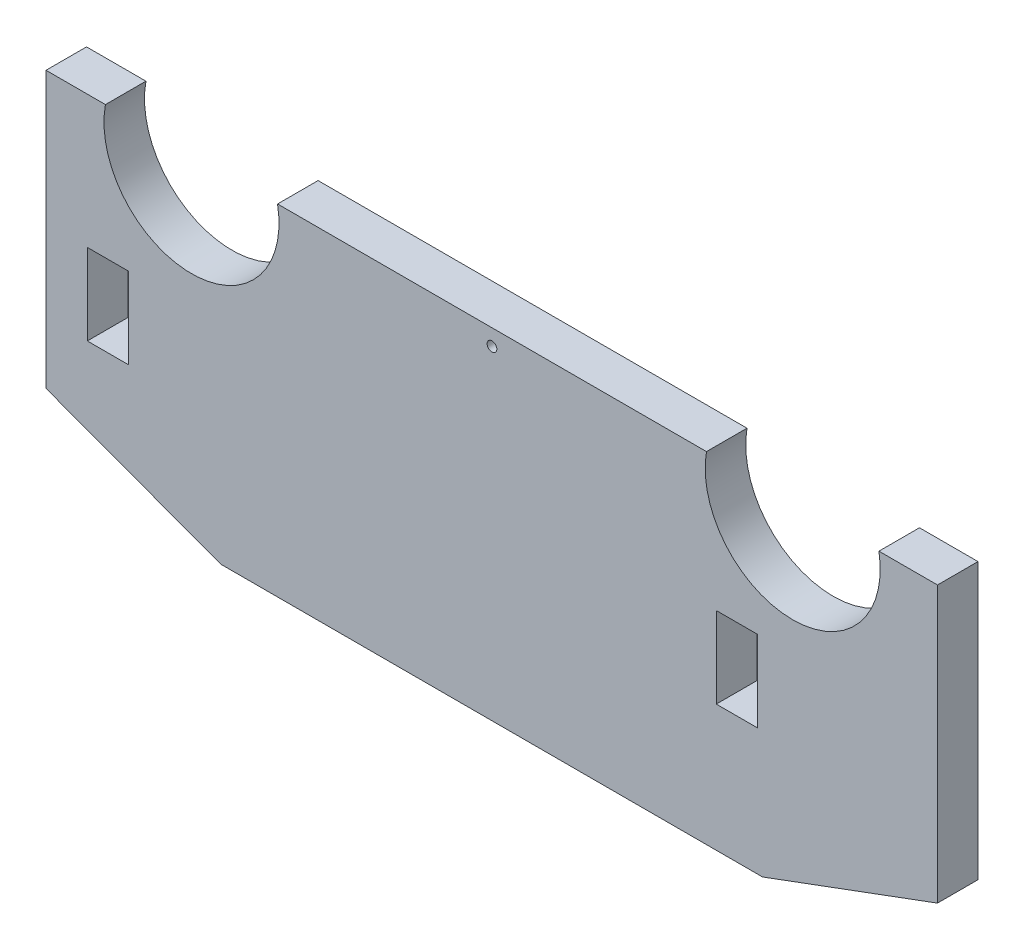
ISO-10303-21;
HEADER;
FILE_DESCRIPTION(('STEP AP214'),'2;1');
FILE_NAME('part.step','',(''),(''),'','','');
FILE_SCHEMA(('AUTOMOTIVE_DESIGN { 1 0 10303 214 1 1 1 1 }'));
ENDSEC;
DATA;
#1=APPLICATION_CONTEXT('core data for automotive mechanical design processes');
#2=APPLICATION_PROTOCOL_DEFINITION('international standard','automotive_design',2000,#1);
#3=PRODUCT_CONTEXT('',#1,'mechanical');
#4=PRODUCT('Part','Part','',(#3));
#5=PRODUCT_RELATED_PRODUCT_CATEGORY('part','',(#4));
#6=PRODUCT_DEFINITION_FORMATION('','',#4);
#7=PRODUCT_DEFINITION_CONTEXT('part definition',#1,'design');
#8=PRODUCT_DEFINITION('design','',#6,#7);
#9=PRODUCT_DEFINITION_SHAPE('','',#8);
#10=(LENGTH_UNIT() NAMED_UNIT(*) SI_UNIT(.MILLI.,.METRE.));
#11=(NAMED_UNIT(*) PLANE_ANGLE_UNIT() SI_UNIT($,.RADIAN.));
#12=(NAMED_UNIT(*) SI_UNIT($,.STERADIAN.) SOLID_ANGLE_UNIT());
#13=UNCERTAINTY_MEASURE_WITH_UNIT(LENGTH_MEASURE(1.E-05),#10,'distance_accuracy_value','');
#14=(GEOMETRIC_REPRESENTATION_CONTEXT(3) GLOBAL_UNCERTAINTY_ASSIGNED_CONTEXT((#13)) GLOBAL_UNIT_ASSIGNED_CONTEXT((#10,
#11,#12)) REPRESENTATION_CONTEXT('',''));
#15=CARTESIAN_POINT('',(0.,0.,0.));
#16=DIRECTION('',(0.,0.,1.));
#17=DIRECTION('',(1.,0.,0.));
#18=AXIS2_PLACEMENT_3D('',#15,#16,#17);
#19=CARTESIAN_POINT('',(-34.925,9.525,3.175));
#20=DIRECTION('',(0.,-1.,0.));
#21=DIRECTION('',(0.,0.,-1.));
#22=AXIS2_PLACEMENT_3D('',#19,#20,#21);
#23=PLANE('',#22);
#24=DIRECTION('',(-1.,0.,0.));
#25=VECTOR('',#24,1.);
#26=CARTESIAN_POINT('',(-34.925,9.525,0.));
#27=LINE('',#26,#25);
#28=CARTESIAN_POINT('',(34.925,9.525,0.));
#29=VERTEX_POINT('',#28);
#30=CARTESIAN_POINT('',(30.337818848547,9.525,0.));
#31=VERTEX_POINT('',#30);
#32=EDGE_CURVE('E187',#29,#31,#27,.T.);
#33=ORIENTED_EDGE('',*,*,#32,.T.);
#34=DIRECTION('',(0.,0.,1.));
#35=VECTOR('',#34,1.);
#36=CARTESIAN_POINT('',(30.337818848547,9.525,0.));
#37=LINE('',#36,#35);
#38=CARTESIAN_POINT('',(30.337818848547,9.525,3.175));
#39=VERTEX_POINT('',#38);
#40=EDGE_CURVE('E46',#31,#39,#37,.T.);
#41=ORIENTED_EDGE('',*,*,#40,.T.);
#42=DIRECTION('',(-1.,0.,0.));
#43=VECTOR('',#42,1.);
#44=CARTESIAN_POINT('',(-34.925,9.525,3.175));
#45=LINE('',#44,#43);
#46=CARTESIAN_POINT('',(34.925,9.525,3.175));
#47=VERTEX_POINT('',#46);
#48=EDGE_CURVE('E168',#47,#39,#45,.T.);
#49=ORIENTED_EDGE('',*,*,#48,.F.);
#50=DIRECTION('',(0.,0.,-1.));
#51=VECTOR('',#50,1.);
#52=CARTESIAN_POINT('',(34.925,9.525,3.175));
#53=LINE('',#52,#51);
#54=EDGE_CURVE('E194',#47,#29,#53,.T.);
#55=ORIENTED_EDGE('',*,*,#54,.T.);
#56=EDGE_LOOP('',(#33,#41,#49,#55));
#57=FACE_BOUND('',#56,.T.);
#58=ADVANCED_FACE('F32',(#57),#23,.F.);
#59=CARTESIAN_POINT('',(16.8247980446848,9.525,3.175));
#60=VERTEX_POINT('',#59);
#61=CARTESIAN_POINT('',(-16.781802364217,9.525,3.175));
#62=VERTEX_POINT('',#61);
#63=EDGE_CURVE('E165',#60,#62,#45,.T.);
#64=ORIENTED_EDGE('',*,*,#63,.F.);
#65=DIRECTION('',(0.,0.,1.));
#66=VECTOR('',#65,1.);
#67=CARTESIAN_POINT('',(16.8247980446848,9.525,0.));
#68=LINE('',#67,#66);
#69=CARTESIAN_POINT('',(16.8247980446848,9.525,0.));
#70=VERTEX_POINT('',#69);
#71=EDGE_CURVE('E155',#60,#70,#68,.F.);
#72=ORIENTED_EDGE('',*,*,#71,.T.);
#73=CARTESIAN_POINT('',(-16.781802364217,9.525,0.));
#74=VERTEX_POINT('',#73);
#75=EDGE_CURVE('E54',#70,#74,#27,.T.);
#76=ORIENTED_EDGE('',*,*,#75,.T.);
#77=DIRECTION('',(0.,0.,1.));
#78=VECTOR('',#77,1.);
#79=CARTESIAN_POINT('',(-16.781802364217,9.525,0.));
#80=LINE('',#79,#78);
#81=EDGE_CURVE('E172',#74,#62,#80,.T.);
#82=ORIENTED_EDGE('',*,*,#81,.T.);
#83=EDGE_LOOP('',(#64,#72,#76,#82));
#84=FACE_BOUND('',#83,.T.);
#85=ADVANCED_FACE('F171',(#84),#23,.F.);
#86=CARTESIAN_POINT('',(34.925,-9.525,3.175));
#87=DIRECTION('',(-1.,0.,0.));
#88=DIRECTION('',(0.,0.,1.));
#89=AXIS2_PLACEMENT_3D('',#86,#87,#88);
#90=PLANE('',#89);
#91=DIRECTION('',(0.,1.,0.));
#92=VECTOR('',#91,1.);
#93=CARTESIAN_POINT('',(34.925,-9.525,0.));
#94=LINE('',#93,#92);
#95=CARTESIAN_POINT('',(34.925,-12.065,0.));
#96=VERTEX_POINT('',#95);
#97=EDGE_CURVE('E182',#96,#29,#94,.T.);
#98=ORIENTED_EDGE('',*,*,#97,.T.);
#99=ORIENTED_EDGE('',*,*,#54,.F.);
#100=DIRECTION('',(0.,1.,0.));
#101=VECTOR('',#100,1.);
#102=CARTESIAN_POINT('',(34.925,-9.525,3.175));
#103=LINE('',#102,#101);
#104=CARTESIAN_POINT('',(34.925,-12.065,3.175));
#105=VERTEX_POINT('',#104);
#106=EDGE_CURVE('E176',#105,#47,#103,.T.);
#107=ORIENTED_EDGE('',*,*,#106,.F.);
#108=DIRECTION('',(0.,0.,1.));
#109=VECTOR('',#108,1.);
#110=CARTESIAN_POINT('',(34.925,-12.065,0.));
#111=LINE('',#110,#109);
#112=EDGE_CURVE('E233',#96,#105,#111,.T.);
#113=ORIENTED_EDGE('',*,*,#112,.F.);
#114=EDGE_LOOP('',(#98,#99,#107,#113));
#115=FACE_BOUND('',#114,.T.);
#116=ADVANCED_FACE('F34',(#115),#90,.F.);
#117=CARTESIAN_POINT('',(-30.2698721922055,9.525,3.175));
#118=VERTEX_POINT('',#117);
#119=CARTESIAN_POINT('',(-34.925,9.525,3.175));
#120=VERTEX_POINT('',#119);
#121=EDGE_CURVE('E173',#118,#120,#45,.T.);
#122=ORIENTED_EDGE('',*,*,#121,.F.);
#123=DIRECTION('',(0.,0.,1.));
#124=VECTOR('',#123,1.);
#125=CARTESIAN_POINT('',(-30.2698721922055,9.525,0.));
#126=LINE('',#125,#124);
#127=CARTESIAN_POINT('',(-30.2698721922055,9.525,0.));
#128=VERTEX_POINT('',#127);
#129=EDGE_CURVE('E200',#118,#128,#126,.F.);
#130=ORIENTED_EDGE('',*,*,#129,.T.);
#131=CARTESIAN_POINT('',(-34.925,9.525,0.));
#132=VERTEX_POINT('',#131);
#133=EDGE_CURVE('E185',#128,#132,#27,.T.);
#134=ORIENTED_EDGE('',*,*,#133,.T.);
#135=DIRECTION('',(0.,0.,-1.));
#136=VECTOR('',#135,1.);
#137=CARTESIAN_POINT('',(-34.925,9.525,3.175));
#138=LINE('',#137,#136);
#139=EDGE_CURVE('E181',#120,#132,#138,.T.);
#140=ORIENTED_EDGE('',*,*,#139,.F.);
#141=EDGE_LOOP('',(#122,#130,#134,#140));
#142=FACE_BOUND('',#141,.T.);
#143=ADVANCED_FACE('F205',(#142),#23,.F.);
#144=CARTESIAN_POINT('',(-34.925,-9.525,3.175));
#145=DIRECTION('',(1.,0.,0.));
#146=DIRECTION('',(0.,0.,-1.));
#147=AXIS2_PLACEMENT_3D('',#144,#145,#146);
#148=PLANE('',#147);
#149=DIRECTION('',(0.,-1.,0.));
#150=VECTOR('',#149,1.);
#151=CARTESIAN_POINT('',(-34.925,-9.525,0.));
#152=LINE('',#151,#150);
#153=CARTESIAN_POINT('',(-34.925,-12.065,0.));
#154=VERTEX_POINT('',#153);
#155=EDGE_CURVE('E190',#132,#154,#152,.T.);
#156=ORIENTED_EDGE('',*,*,#155,.T.);
#157=DIRECTION('',(0.,0.,1.));
#158=VECTOR('',#157,1.);
#159=CARTESIAN_POINT('',(-34.925,-12.065,0.));
#160=LINE('',#159,#158);
#161=CARTESIAN_POINT('',(-34.925,-12.065,3.175));
#162=VERTEX_POINT('',#161);
#163=EDGE_CURVE('E221',#154,#162,#160,.T.);
#164=ORIENTED_EDGE('',*,*,#163,.T.);
#165=DIRECTION('',(0.,-1.,0.));
#166=VECTOR('',#165,1.);
#167=CARTESIAN_POINT('',(-34.925,-9.525,3.175));
#168=LINE('',#167,#166);
#169=EDGE_CURVE('E175',#120,#162,#168,.T.);
#170=ORIENTED_EDGE('',*,*,#169,.F.);
#171=ORIENTED_EDGE('',*,*,#139,.T.);
#172=EDGE_LOOP('',(#156,#164,#170,#171));
#173=FACE_BOUND('',#172,.T.);
#174=ADVANCED_FACE('F219',(#173),#148,.F.);
#175=CARTESIAN_POINT('',(34.925,9.525,3.175));
#176=DIRECTION('',(0.,0.,-1.));
#177=DIRECTION('',(-1.,0.,0.));
#178=AXIS2_PLACEMENT_3D('',#175,#176,#177);
#179=PLANE('',#178);
#180=CARTESIAN_POINT('',(0.018631461536054,8.255,3.175));
#181=DIRECTION('',(0.,0.,1.));
#182=DIRECTION('',(1.,0.,0.));
#183=AXIS2_PLACEMENT_3D('',#180,#181,#182);
#184=CIRCLE('',#183,0.381);
#185=CARTESIAN_POINT('',(0.399631461536054,8.255,3.175));
#186=VERTEX_POINT('',#185);
#187=EDGE_CURVE('E314',#186,#186,#184,.T.);
#188=ORIENTED_EDGE('',*,*,#187,.F.);
#189=EDGE_LOOP('',(#188));
#190=FACE_BOUND('',#189,.T.);
#191=DIRECTION('',(-1.,0.,0.));
#192=VECTOR('',#191,1.);
#193=CARTESIAN_POINT('',(17.5928228104329,-0.875352195852146,3.175));
#194=LINE('',#193,#192);
#195=CARTESIAN_POINT('',(20.8186228104329,-0.875352195852146,3.175));
#196=VERTEX_POINT('',#195);
#197=CARTESIAN_POINT('',(17.5928228104329,-0.875352195852146,3.175));
#198=VERTEX_POINT('',#197);
#199=EDGE_CURVE('E296',#196,#198,#194,.T.);
#200=ORIENTED_EDGE('',*,*,#199,.F.);
#201=DIRECTION('',(0.,1.,0.));
#202=VECTOR('',#201,1.);
#203=CARTESIAN_POINT('',(20.8186228104329,-0.875352195852146,3.175));
#204=LINE('',#203,#202);
#205=CARTESIAN_POINT('',(20.8186228104329,-7.22535219585215,3.175));
#206=VERTEX_POINT('',#205);
#207=EDGE_CURVE('E299',#206,#196,#204,.T.);
#208=ORIENTED_EDGE('',*,*,#207,.F.);
#209=DIRECTION('',(1.,0.,0.));
#210=VECTOR('',#209,1.);
#211=CARTESIAN_POINT('',(17.5928228104329,-7.22535219585215,3.175));
#212=LINE('',#211,#210);
#213=CARTESIAN_POINT('',(17.5928228104329,-7.22535219585215,3.175));
#214=VERTEX_POINT('',#213);
#215=EDGE_CURVE('E289',#214,#206,#212,.T.);
#216=ORIENTED_EDGE('',*,*,#215,.F.);
#217=DIRECTION('',(0.,-1.,0.));
#218=VECTOR('',#217,1.);
#219=CARTESIAN_POINT('',(17.5928228104329,-0.875352195852146,3.175));
#220=LINE('',#219,#218);
#221=EDGE_CURVE('E293',#198,#214,#220,.T.);
#222=ORIENTED_EDGE('',*,*,#221,.F.);
#223=EDGE_LOOP('',(#200,#208,#216,#222));
#224=FACE_BOUND('',#223,.T.);
#225=DIRECTION('',(-1.,0.,0.));
#226=VECTOR('',#225,1.);
#227=CARTESIAN_POINT('',(-31.6890002778656,-0.875352195852147,3.175));
#228=LINE('',#227,#226);
#229=CARTESIAN_POINT('',(-28.4632002778656,-0.875352195852146,3.175));
#230=VERTEX_POINT('',#229);
#231=CARTESIAN_POINT('',(-31.6890002778656,-0.875352195852147,3.175));
#232=VERTEX_POINT('',#231);
#233=EDGE_CURVE('E264',#230,#232,#228,.T.);
#234=ORIENTED_EDGE('',*,*,#233,.F.);
#235=DIRECTION('',(0.,1.,0.));
#236=VECTOR('',#235,1.);
#237=CARTESIAN_POINT('',(-28.4632002778656,-0.875352195852147,3.175));
#238=LINE('',#237,#236);
#239=CARTESIAN_POINT('',(-28.4632002778656,-7.22535219585215,3.175));
#240=VERTEX_POINT('',#239);
#241=EDGE_CURVE('E267',#240,#230,#238,.T.);
#242=ORIENTED_EDGE('',*,*,#241,.F.);
#243=DIRECTION('',(1.,0.,0.));
#244=VECTOR('',#243,1.);
#245=CARTESIAN_POINT('',(-31.6890002778656,-7.22535219585215,3.175));
#246=LINE('',#245,#244);
#247=CARTESIAN_POINT('',(-31.6890002778656,-7.22535219585215,3.175));
#248=VERTEX_POINT('',#247);
#249=EDGE_CURVE('E257',#248,#240,#246,.T.);
#250=ORIENTED_EDGE('',*,*,#249,.F.);
#251=DIRECTION('',(0.,-1.,0.));
#252=VECTOR('',#251,1.);
#253=CARTESIAN_POINT('',(-31.6890002778656,-0.875352195852147,3.175));
#254=LINE('',#253,#252);
#255=EDGE_CURVE('E261',#232,#248,#254,.T.);
#256=ORIENTED_EDGE('',*,*,#255,.F.);
#257=EDGE_LOOP('',(#234,#242,#250,#256));
#258=FACE_BOUND('',#257,.T.);
#259=ORIENTED_EDGE('',*,*,#48,.T.);
#260=CARTESIAN_POINT('',(23.5813084466159,8.34952937571165,3.175));
#261=DIRECTION('',(0.,0.,1.));
#262=DIRECTION('',(1.,0.,0.));
#263=AXIS2_PLACEMENT_3D('',#260,#261,#262);
#264=CIRCLE('',#263,6.85799999999766);
#265=EDGE_CURVE('E158',#60,#39,#264,.T.);
#266=ORIENTED_EDGE('',*,*,#265,.F.);
#267=ORIENTED_EDGE('',*,*,#63,.T.);
#268=CARTESIAN_POINT('',(-23.5258372782112,8.2799469574375,3.175));
#269=DIRECTION('',(0.,0.,1.));
#270=DIRECTION('',(1.,0.,0.));
#271=AXIS2_PLACEMENT_3D('',#268,#269,#270);
#272=CIRCLE('',#271,6.85799999999766);
#273=EDGE_CURVE('E207',#118,#62,#272,.T.);
#274=ORIENTED_EDGE('',*,*,#273,.F.);
#275=ORIENTED_EDGE('',*,*,#121,.T.);
#276=ORIENTED_EDGE('',*,*,#169,.T.);
#277=DIRECTION('',(0.937699685695736,-0.347446829667674,0.));
#278=VECTOR('',#277,1.);
#279=CARTESIAN_POINT('',(-34.925,-12.065,3.175));
#280=LINE('',#279,#278);
#281=CARTESIAN_POINT('',(-21.2149471326576,-17.145,3.175));
#282=VERTEX_POINT('',#281);
#283=EDGE_CURVE('E226',#162,#282,#280,.T.);
#284=ORIENTED_EDGE('',*,*,#283,.T.);
#285=DIRECTION('',(1.,0.,0.));
#286=VECTOR('',#285,1.);
#287=CARTESIAN_POINT('',(-21.2149471326576,-17.145,3.175));
#288=LINE('',#287,#286);
#289=CARTESIAN_POINT('',(21.2149471326576,-17.145,3.175));
#290=VERTEX_POINT('',#289);
#291=EDGE_CURVE('E231',#282,#290,#288,.T.);
#292=ORIENTED_EDGE('',*,*,#291,.T.);
#293=DIRECTION('',(-0.937699685695736,-0.347446829667674,0.));
#294=VECTOR('',#293,1.);
#295=CARTESIAN_POINT('',(34.925,-12.065,3.175));
#296=LINE('',#295,#294);
#297=EDGE_CURVE('E242',#105,#290,#296,.T.);
#298=ORIENTED_EDGE('',*,*,#297,.F.);
#299=ORIENTED_EDGE('',*,*,#106,.T.);
#300=EDGE_LOOP('',(#259,#266,#267,#274,#275,#276,#284,#292,#298,#299));
#301=FACE_BOUND('',#300,.T.);
#302=ADVANCED_FACE('F163',(#190,#224,#258,#301),#179,.F.);
#303=CARTESIAN_POINT('',(34.925,9.525,0.));
#304=DIRECTION('',(0.,0.,-1.));
#305=DIRECTION('',(-1.,0.,0.));
#306=AXIS2_PLACEMENT_3D('',#303,#304,#305);
#307=PLANE('',#306);
#308=CARTESIAN_POINT('',(0.018631461536054,8.255,0.));
#309=DIRECTION('',(0.,0.,1.));
#310=DIRECTION('',(1.,0.,0.));
#311=AXIS2_PLACEMENT_3D('',#308,#309,#310);
#312=CIRCLE('',#311,0.381);
#313=CARTESIAN_POINT('',(0.399631461536054,8.255,0.));
#314=VERTEX_POINT('',#313);
#315=EDGE_CURVE('E169',#314,#314,#312,.T.);
#316=ORIENTED_EDGE('',*,*,#315,.T.);
#317=EDGE_LOOP('',(#316));
#318=FACE_BOUND('',#317,.T.);
#319=CARTESIAN_POINT('',(23.5813084466159,8.34952937571165,0.));
#320=DIRECTION('',(0.,0.,-1.));
#321=DIRECTION('',(-1.,0.,0.));
#322=AXIS2_PLACEMENT_3D('',#319,#320,#321);
#323=CIRCLE('',#322,6.85799999999766);
#324=EDGE_CURVE('E11',#31,#70,#323,.T.);
#325=ORIENTED_EDGE('',*,*,#324,.F.);
#326=ORIENTED_EDGE('',*,*,#32,.F.);
#327=ORIENTED_EDGE('',*,*,#97,.F.);
#328=DIRECTION('',(-0.937699685695736,-0.347446829667674,0.));
#329=VECTOR('',#328,1.);
#330=CARTESIAN_POINT('',(34.925,-12.065,0.));
#331=LINE('',#330,#329);
#332=CARTESIAN_POINT('',(21.2149471326576,-17.145,0.));
#333=VERTEX_POINT('',#332);
#334=EDGE_CURVE('E239',#96,#333,#331,.T.);
#335=ORIENTED_EDGE('',*,*,#334,.T.);
#336=DIRECTION('',(1.,0.,0.));
#337=VECTOR('',#336,1.);
#338=CARTESIAN_POINT('',(-21.2149471326576,-17.145,0.));
#339=LINE('',#338,#337);
#340=CARTESIAN_POINT('',(-21.2149471326576,-17.145,0.));
#341=VERTEX_POINT('',#340);
#342=EDGE_CURVE('E227',#341,#333,#339,.T.);
#343=ORIENTED_EDGE('',*,*,#342,.F.);
#344=DIRECTION('',(0.937699685695736,-0.347446829667674,0.));
#345=VECTOR('',#344,1.);
#346=CARTESIAN_POINT('',(-34.925,-12.065,0.));
#347=LINE('',#346,#345);
#348=EDGE_CURVE('E215',#154,#341,#347,.T.);
#349=ORIENTED_EDGE('',*,*,#348,.F.);
#350=ORIENTED_EDGE('',*,*,#155,.F.);
#351=ORIENTED_EDGE('',*,*,#133,.F.);
#352=CARTESIAN_POINT('',(-23.5258372782112,8.2799469574375,0.));
#353=DIRECTION('',(0.,0.,-1.));
#354=DIRECTION('',(-1.,0.,0.));
#355=AXIS2_PLACEMENT_3D('',#352,#353,#354);
#356=CIRCLE('',#355,6.85799999999766);
#357=EDGE_CURVE('E40',#74,#128,#356,.T.);
#358=ORIENTED_EDGE('',*,*,#357,.F.);
#359=ORIENTED_EDGE('',*,*,#75,.F.);
#360=EDGE_LOOP('',(#325,#326,#327,#335,#343,#349,#350,#351,#358,#359));
#361=FACE_BOUND('',#360,.T.);
#362=DIRECTION('',(0.,1.,0.));
#363=VECTOR('',#362,1.);
#364=CARTESIAN_POINT('',(20.8186228104329,-0.875352195852146,0.));
#365=LINE('',#364,#363);
#366=CARTESIAN_POINT('',(20.8186228104329,-7.22535219585215,0.));
#367=VERTEX_POINT('',#366);
#368=CARTESIAN_POINT('',(20.8186228104329,-0.875352195852146,0.));
#369=VERTEX_POINT('',#368);
#370=EDGE_CURVE('E292',#367,#369,#365,.T.);
#371=ORIENTED_EDGE('',*,*,#370,.T.);
#372=DIRECTION('',(-1.,0.,0.));
#373=VECTOR('',#372,1.);
#374=CARTESIAN_POINT('',(17.5928228104329,-0.875352195852146,0.));
#375=LINE('',#374,#373);
#376=CARTESIAN_POINT('',(17.5928228104329,-0.875352195852146,0.));
#377=VERTEX_POINT('',#376);
#378=EDGE_CURVE('E306',#369,#377,#375,.T.);
#379=ORIENTED_EDGE('',*,*,#378,.T.);
#380=DIRECTION('',(0.,-1.,0.));
#381=VECTOR('',#380,1.);
#382=CARTESIAN_POINT('',(17.5928228104329,-0.875352195852146,0.));
#383=LINE('',#382,#381);
#384=CARTESIAN_POINT('',(17.5928228104329,-7.22535219585215,0.));
#385=VERTEX_POINT('',#384);
#386=EDGE_CURVE('E303',#377,#385,#383,.T.);
#387=ORIENTED_EDGE('',*,*,#386,.T.);
#388=DIRECTION('',(1.,0.,0.));
#389=VECTOR('',#388,1.);
#390=CARTESIAN_POINT('',(17.5928228104329,-7.22535219585215,0.));
#391=LINE('',#390,#389);
#392=EDGE_CURVE('E284',#385,#367,#391,.T.);
#393=ORIENTED_EDGE('',*,*,#392,.T.);
#394=EDGE_LOOP('',(#371,#379,#387,#393));
#395=FACE_BOUND('',#394,.T.);
#396=DIRECTION('',(0.,1.,0.));
#397=VECTOR('',#396,1.);
#398=CARTESIAN_POINT('',(-28.4632002778656,-0.875352195852147,0.));
#399=LINE('',#398,#397);
#400=CARTESIAN_POINT('',(-28.4632002778656,-7.22535219585215,0.));
#401=VERTEX_POINT('',#400);
#402=CARTESIAN_POINT('',(-28.4632002778656,-0.875352195852147,0.));
#403=VERTEX_POINT('',#402);
#404=EDGE_CURVE('E260',#401,#403,#399,.T.);
#405=ORIENTED_EDGE('',*,*,#404,.T.);
#406=DIRECTION('',(-1.,0.,0.));
#407=VECTOR('',#406,1.);
#408=CARTESIAN_POINT('',(-31.6890002778656,-0.875352195852147,0.));
#409=LINE('',#408,#407);
#410=CARTESIAN_POINT('',(-31.6890002778656,-0.875352195852146,0.));
#411=VERTEX_POINT('',#410);
#412=EDGE_CURVE('E275',#403,#411,#409,.T.);
#413=ORIENTED_EDGE('',*,*,#412,.T.);
#414=DIRECTION('',(0.,-1.,0.));
#415=VECTOR('',#414,1.);
#416=CARTESIAN_POINT('',(-31.6890002778656,-0.875352195852147,0.));
#417=LINE('',#416,#415);
#418=CARTESIAN_POINT('',(-31.6890002778656,-7.22535219585215,0.));
#419=VERTEX_POINT('',#418);
#420=EDGE_CURVE('E272',#411,#419,#417,.T.);
#421=ORIENTED_EDGE('',*,*,#420,.T.);
#422=DIRECTION('',(1.,0.,0.));
#423=VECTOR('',#422,1.);
#424=CARTESIAN_POINT('',(-31.6890002778656,-7.22535219585215,0.));
#425=LINE('',#424,#423);
#426=EDGE_CURVE('E252',#419,#401,#425,.T.);
#427=ORIENTED_EDGE('',*,*,#426,.T.);
#428=EDGE_LOOP('',(#405,#413,#421,#427));
#429=FACE_BOUND('',#428,.T.);
#430=ADVANCED_FACE('F210',(#318,#361,#395,#429),#307,.T.);
#431=CARTESIAN_POINT('',(-21.2149471326576,-17.145,0.));
#432=DIRECTION('',(0.,-1.,0.));
#433=DIRECTION('',(0.,0.,-1.));
#434=AXIS2_PLACEMENT_3D('',#431,#432,#433);
#435=PLANE('',#434);
#436=ORIENTED_EDGE('',*,*,#291,.F.);
#437=DIRECTION('',(0.,0.,1.));
#438=VECTOR('',#437,1.);
#439=CARTESIAN_POINT('',(-21.2149471326576,-17.145,0.));
#440=LINE('',#439,#438);
#441=EDGE_CURVE('E186',#341,#282,#440,.T.);
#442=ORIENTED_EDGE('',*,*,#441,.F.);
#443=ORIENTED_EDGE('',*,*,#342,.T.);
#444=DIRECTION('',(0.,0.,1.));
#445=VECTOR('',#444,1.);
#446=CARTESIAN_POINT('',(21.2149471326576,-17.145,0.));
#447=LINE('',#446,#445);
#448=EDGE_CURVE('E236',#333,#290,#447,.T.);
#449=ORIENTED_EDGE('',*,*,#448,.T.);
#450=EDGE_LOOP('',(#436,#442,#443,#449));
#451=FACE_BOUND('',#450,.T.);
#452=ADVANCED_FACE('F352',(#451),#435,.T.);
#453=CARTESIAN_POINT('',(-34.925,-12.065,0.));
#454=DIRECTION('',(-0.347446829667674,-0.937699685695736,0.));
#455=DIRECTION('',(0.937699685695736,-0.347446829667674,0.));
#456=AXIS2_PLACEMENT_3D('',#453,#454,#455);
#457=PLANE('',#456);
#458=ORIENTED_EDGE('',*,*,#283,.F.);
#459=ORIENTED_EDGE('',*,*,#163,.F.);
#460=ORIENTED_EDGE('',*,*,#348,.T.);
#461=ORIENTED_EDGE('',*,*,#441,.T.);
#462=EDGE_LOOP('',(#458,#459,#460,#461));
#463=FACE_BOUND('',#462,.T.);
#464=ADVANCED_FACE('F224',(#463),#457,.T.);
#465=CARTESIAN_POINT('',(34.925,-12.065,0.));
#466=DIRECTION('',(-0.347446829667674,0.937699685695736,0.));
#467=DIRECTION('',(-0.937699685695736,-0.347446829667674,0.));
#468=AXIS2_PLACEMENT_3D('',#465,#466,#467);
#469=PLANE('',#468);
#470=ORIENTED_EDGE('',*,*,#297,.T.);
#471=ORIENTED_EDGE('',*,*,#448,.F.);
#472=ORIENTED_EDGE('',*,*,#334,.F.);
#473=ORIENTED_EDGE('',*,*,#112,.T.);
#474=EDGE_LOOP('',(#470,#471,#472,#473));
#475=FACE_BOUND('',#474,.T.);
#476=ADVANCED_FACE('F380',(#475),#469,.F.);
#477=CARTESIAN_POINT('',(-28.4632002778656,-0.875352195852147,0.));
#478=DIRECTION('',(1.,0.,0.));
#479=DIRECTION('',(0.,0.,-1.));
#480=AXIS2_PLACEMENT_3D('',#477,#478,#479);
#481=PLANE('',#480);
#482=ORIENTED_EDGE('',*,*,#241,.T.);
#483=DIRECTION('',(0.,0.,1.));
#484=VECTOR('',#483,1.);
#485=CARTESIAN_POINT('',(-28.4632002778656,-0.875352195852147,0.));
#486=LINE('',#485,#484);
#487=EDGE_CURVE('E248',#403,#230,#486,.T.);
#488=ORIENTED_EDGE('',*,*,#487,.F.);
#489=ORIENTED_EDGE('',*,*,#404,.F.);
#490=DIRECTION('',(0.,0.,1.));
#491=VECTOR('',#490,1.);
#492=CARTESIAN_POINT('',(-28.4632002778656,-7.22535219585215,0.));
#493=LINE('',#492,#491);
#494=EDGE_CURVE('E245',#401,#240,#493,.T.);
#495=ORIENTED_EDGE('',*,*,#494,.T.);
#496=EDGE_LOOP('',(#482,#488,#489,#495));
#497=FACE_BOUND('',#496,.T.);
#498=ADVANCED_FACE('F344',(#497),#481,.F.);
#499=CARTESIAN_POINT('',(-31.6890002778656,-7.22535219585215,0.));
#500=DIRECTION('',(0.,-1.,0.));
#501=DIRECTION('',(0.,0.,-1.));
#502=AXIS2_PLACEMENT_3D('',#499,#500,#501);
#503=PLANE('',#502);
#504=ORIENTED_EDGE('',*,*,#249,.T.);
#505=ORIENTED_EDGE('',*,*,#494,.F.);
#506=ORIENTED_EDGE('',*,*,#426,.F.);
#507=DIRECTION('',(0.,0.,1.));
#508=VECTOR('',#507,1.);
#509=CARTESIAN_POINT('',(-31.6890002778656,-7.22535219585215,0.));
#510=LINE('',#509,#508);
#511=EDGE_CURVE('E254',#419,#248,#510,.T.);
#512=ORIENTED_EDGE('',*,*,#511,.T.);
#513=EDGE_LOOP('',(#504,#505,#506,#512));
#514=FACE_BOUND('',#513,.T.);
#515=ADVANCED_FACE('F347',(#514),#503,.F.);
#516=CARTESIAN_POINT('',(-31.6890002778656,-0.875352195852147,0.));
#517=DIRECTION('',(-1.,0.,0.));
#518=DIRECTION('',(0.,0.,1.));
#519=AXIS2_PLACEMENT_3D('',#516,#517,#518);
#520=PLANE('',#519);
#521=ORIENTED_EDGE('',*,*,#255,.T.);
#522=ORIENTED_EDGE('',*,*,#511,.F.);
#523=ORIENTED_EDGE('',*,*,#420,.F.);
#524=DIRECTION('',(0.,0.,1.));
#525=VECTOR('',#524,1.);
#526=CARTESIAN_POINT('',(-31.6890002778656,-0.875352195852147,0.));
#527=LINE('',#526,#525);
#528=EDGE_CURVE('E251',#411,#232,#527,.T.);
#529=ORIENTED_EDGE('',*,*,#528,.T.);
#530=EDGE_LOOP('',(#521,#522,#523,#529));
#531=FACE_BOUND('',#530,.T.);
#532=ADVANCED_FACE('F349',(#531),#520,.F.);
#533=CARTESIAN_POINT('',(-31.6890002778656,-0.875352195852147,0.));
#534=DIRECTION('',(0.,1.,0.));
#535=DIRECTION('',(0.,0.,1.));
#536=AXIS2_PLACEMENT_3D('',#533,#534,#535);
#537=PLANE('',#536);
#538=ORIENTED_EDGE('',*,*,#233,.T.);
#539=ORIENTED_EDGE('',*,*,#528,.F.);
#540=ORIENTED_EDGE('',*,*,#412,.F.);
#541=ORIENTED_EDGE('',*,*,#487,.T.);
#542=EDGE_LOOP('',(#538,#539,#540,#541));
#543=FACE_BOUND('',#542,.T.);
#544=ADVANCED_FACE('F340',(#543),#537,.F.);
#545=CARTESIAN_POINT('',(20.8186228104329,-0.875352195852146,0.));
#546=DIRECTION('',(1.,0.,0.));
#547=DIRECTION('',(0.,0.,-1.));
#548=AXIS2_PLACEMENT_3D('',#545,#546,#547);
#549=PLANE('',#548);
#550=ORIENTED_EDGE('',*,*,#207,.T.);
#551=DIRECTION('',(0.,0.,1.));
#552=VECTOR('',#551,1.);
#553=CARTESIAN_POINT('',(20.8186228104329,-0.875352195852146,0.));
#554=LINE('',#553,#552);
#555=EDGE_CURVE('E280',#369,#196,#554,.T.);
#556=ORIENTED_EDGE('',*,*,#555,.F.);
#557=ORIENTED_EDGE('',*,*,#370,.F.);
#558=DIRECTION('',(0.,0.,1.));
#559=VECTOR('',#558,1.);
#560=CARTESIAN_POINT('',(20.8186228104329,-7.22535219585215,0.));
#561=LINE('',#560,#559);
#562=EDGE_CURVE('E269',#367,#206,#561,.T.);
#563=ORIENTED_EDGE('',*,*,#562,.T.);
#564=EDGE_LOOP('',(#550,#556,#557,#563));
#565=FACE_BOUND('',#564,.T.);
#566=ADVANCED_FACE('F393',(#565),#549,.F.);
#567=CARTESIAN_POINT('',(17.5928228104329,-7.22535219585215,0.));
#568=DIRECTION('',(0.,-1.,0.));
#569=DIRECTION('',(0.,0.,-1.));
#570=AXIS2_PLACEMENT_3D('',#567,#568,#569);
#571=PLANE('',#570);
#572=ORIENTED_EDGE('',*,*,#215,.T.);
#573=ORIENTED_EDGE('',*,*,#562,.F.);
#574=ORIENTED_EDGE('',*,*,#392,.F.);
#575=DIRECTION('',(0.,0.,1.));
#576=VECTOR('',#575,1.);
#577=CARTESIAN_POINT('',(17.5928228104329,-7.22535219585215,0.));
#578=LINE('',#577,#576);
#579=EDGE_CURVE('E286',#385,#214,#578,.T.);
#580=ORIENTED_EDGE('',*,*,#579,.T.);
#581=EDGE_LOOP('',(#572,#573,#574,#580));
#582=FACE_BOUND('',#581,.T.);
#583=ADVANCED_FACE('F400',(#582),#571,.F.);
#584=CARTESIAN_POINT('',(17.5928228104329,-0.875352195852146,0.));
#585=DIRECTION('',(-1.,0.,0.));
#586=DIRECTION('',(0.,0.,1.));
#587=AXIS2_PLACEMENT_3D('',#584,#585,#586);
#588=PLANE('',#587);
#589=ORIENTED_EDGE('',*,*,#221,.T.);
#590=ORIENTED_EDGE('',*,*,#579,.F.);
#591=ORIENTED_EDGE('',*,*,#386,.F.);
#592=DIRECTION('',(0.,0.,1.));
#593=VECTOR('',#592,1.);
#594=CARTESIAN_POINT('',(17.5928228104329,-0.875352195852146,0.));
#595=LINE('',#594,#593);
#596=EDGE_CURVE('E283',#377,#198,#595,.T.);
#597=ORIENTED_EDGE('',*,*,#596,.T.);
#598=EDGE_LOOP('',(#589,#590,#591,#597));
#599=FACE_BOUND('',#598,.T.);
#600=ADVANCED_FACE('F405',(#599),#588,.F.);
#601=CARTESIAN_POINT('',(17.5928228104329,-0.875352195852146,0.));
#602=DIRECTION('',(0.,1.,0.));
#603=DIRECTION('',(0.,0.,1.));
#604=AXIS2_PLACEMENT_3D('',#601,#602,#603);
#605=PLANE('',#604);
#606=ORIENTED_EDGE('',*,*,#199,.T.);
#607=ORIENTED_EDGE('',*,*,#596,.F.);
#608=ORIENTED_EDGE('',*,*,#378,.F.);
#609=ORIENTED_EDGE('',*,*,#555,.T.);
#610=EDGE_LOOP('',(#606,#607,#608,#609));
#611=FACE_BOUND('',#610,.T.);
#612=ADVANCED_FACE('F402',(#611),#605,.F.);
#613=CARTESIAN_POINT('',(-23.5258372782112,8.2799469574375,0.));
#614=DIRECTION('',(0.,0.,1.));
#615=DIRECTION('',(1.,0.,0.));
#616=AXIS2_PLACEMENT_3D('',#613,#614,#615);
#617=CYLINDRICAL_SURFACE('',#616,6.85799999999766);
#618=ORIENTED_EDGE('',*,*,#357,.T.);
#619=ORIENTED_EDGE('',*,*,#129,.F.);
#620=ORIENTED_EDGE('',*,*,#273,.T.);
#621=ORIENTED_EDGE('',*,*,#81,.F.);
#622=EDGE_LOOP('',(#618,#619,#620,#621));
#623=FACE_BOUND('',#622,.T.);
#624=ADVANCED_FACE('F199',(#623),#617,.F.);
#625=CARTESIAN_POINT('',(23.5813084466159,8.34952937571165,0.));
#626=DIRECTION('',(0.,0.,1.));
#627=DIRECTION('',(1.,0.,0.));
#628=AXIS2_PLACEMENT_3D('',#625,#626,#627);
#629=CYLINDRICAL_SURFACE('',#628,6.85799999999766);
#630=ORIENTED_EDGE('',*,*,#324,.T.);
#631=ORIENTED_EDGE('',*,*,#71,.F.);
#632=ORIENTED_EDGE('',*,*,#265,.T.);
#633=ORIENTED_EDGE('',*,*,#40,.F.);
#634=EDGE_LOOP('',(#630,#631,#632,#633));
#635=FACE_BOUND('',#634,.T.);
#636=ADVANCED_FACE('F157',(#635),#629,.F.);
#637=CARTESIAN_POINT('',(0.018631461536054,8.255,0.));
#638=DIRECTION('',(0.,0.,1.));
#639=DIRECTION('',(1.,0.,0.));
#640=AXIS2_PLACEMENT_3D('',#637,#638,#639);
#641=CYLINDRICAL_SURFACE('',#640,0.381);
#642=ORIENTED_EDGE('',*,*,#315,.F.);
#643=EDGE_LOOP('',(#642));
#644=FACE_BOUND('',#643,.T.);
#645=ORIENTED_EDGE('',*,*,#187,.T.);
#646=EDGE_LOOP('',(#645));
#647=FACE_BOUND('',#646,.T.);
#648=ADVANCED_FACE('F321',(#644,#647),#641,.F.);
#649=CLOSED_SHELL('',(#58,#85,#116,#143,#174,#302,#430,#452,#464,#476,#498,#515,#532,#544,#566,
#583,#600,#612,#624,#636,#648));
#650=MANIFOLD_SOLID_BREP('B2',#649);
#651=ADVANCED_BREP_SHAPE_REPRESENTATION('',(#18,#650),#14);
#652=SHAPE_DEFINITION_REPRESENTATION(#9,#651);
ENDSEC;
END-ISO-10303-21;
